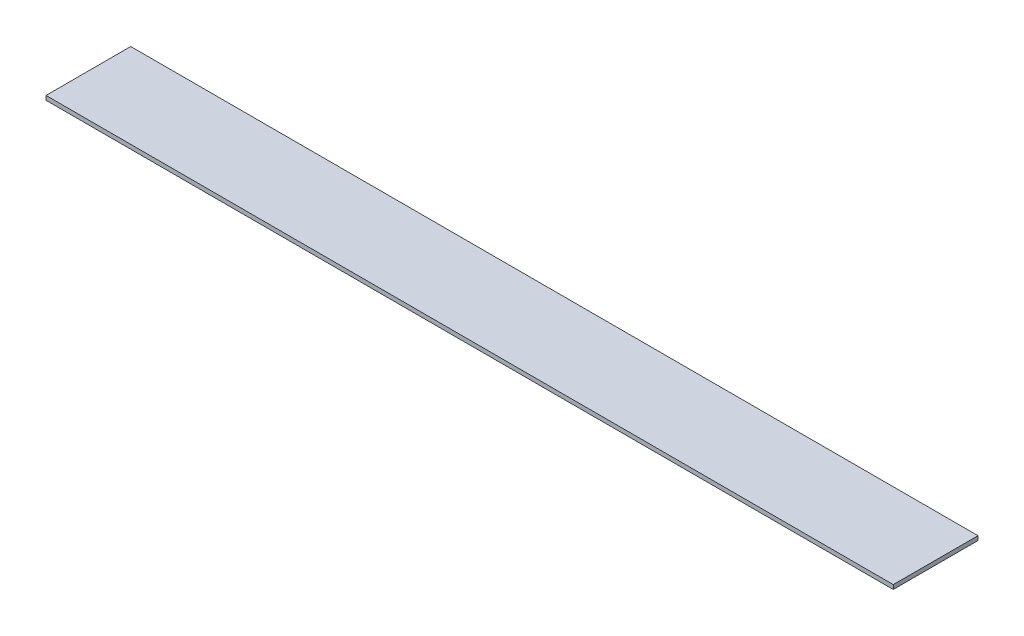
ISO-10303-21;
HEADER;
FILE_DESCRIPTION(('STEP AP214'),'2;1');
FILE_NAME('part.step','',(''),(''),'','','');
FILE_SCHEMA(('AUTOMOTIVE_DESIGN { 1 0 10303 214 1 1 1 1 }'));
ENDSEC;
DATA;
#1=APPLICATION_CONTEXT('core data for automotive mechanical design processes');
#2=APPLICATION_PROTOCOL_DEFINITION('international standard','automotive_design',2000,#1);
#3=PRODUCT_CONTEXT('',#1,'mechanical');
#4=PRODUCT('Part','Part','',(#3));
#5=PRODUCT_RELATED_PRODUCT_CATEGORY('part','',(#4));
#6=PRODUCT_DEFINITION_FORMATION('','',#4);
#7=PRODUCT_DEFINITION_CONTEXT('part definition',#1,'design');
#8=PRODUCT_DEFINITION('design','',#6,#7);
#9=PRODUCT_DEFINITION_SHAPE('','',#8);
#10=(LENGTH_UNIT() NAMED_UNIT(*) SI_UNIT(.MILLI.,.METRE.));
#11=(NAMED_UNIT(*) PLANE_ANGLE_UNIT() SI_UNIT($,.RADIAN.));
#12=(NAMED_UNIT(*) SI_UNIT($,.STERADIAN.) SOLID_ANGLE_UNIT());
#13=UNCERTAINTY_MEASURE_WITH_UNIT(LENGTH_MEASURE(1.E-05),#10,'distance_accuracy_value','');
#14=(GEOMETRIC_REPRESENTATION_CONTEXT(3) GLOBAL_UNCERTAINTY_ASSIGNED_CONTEXT((#13)) GLOBAL_UNIT_ASSIGNED_CONTEXT((#10,
#11,#12)) REPRESENTATION_CONTEXT('',''));
#15=CARTESIAN_POINT('',(0.,0.,0.));
#16=DIRECTION('',(0.,0.,1.));
#17=DIRECTION('',(1.,0.,0.));
#18=AXIS2_PLACEMENT_3D('',#15,#16,#17);
#19=CARTESIAN_POINT('',(300.,1.71683972880179E-13,0.));
#20=DIRECTION('',(-1.,0.,0.));
#21=DIRECTION('',(0.,-1.,0.));
#22=AXIS2_PLACEMENT_3D('',#19,#20,#21);
#23=PLANE('',#22);
#24=DIRECTION('',(0.,-1.,0.));
#25=VECTOR('',#24,1.);
#26=CARTESIAN_POINT('',(300.,3.43367945760358E-13,60.));
#27=LINE('',#26,#25);
#28=CARTESIAN_POINT('',(300.,50.,60.));
#29=VERTEX_POINT('',#28);
#30=CARTESIAN_POINT('',(300.,47.,60.));
#31=VERTEX_POINT('',#30);
#32=EDGE_CURVE('E85',#29,#31,#27,.T.);
#33=ORIENTED_EDGE('',*,*,#32,.T.);
#34=DIRECTION('',(0.,0.,1.));
#35=VECTOR('',#34,1.);
#36=CARTESIAN_POINT('',(300.,47.,3.));
#37=LINE('',#36,#35);
#38=CARTESIAN_POINT('',(300.,47.,0.));
#39=VERTEX_POINT('',#38);
#40=EDGE_CURVE('E41',#39,#31,#37,.T.);
#41=ORIENTED_EDGE('',*,*,#40,.F.);
#42=DIRECTION('',(0.,-1.,0.));
#43=VECTOR('',#42,1.);
#44=CARTESIAN_POINT('',(300.,3.43367945760358E-13,0.));
#45=LINE('',#44,#43);
#46=CARTESIAN_POINT('',(300.,50.,0.));
#47=VERTEX_POINT('',#46);
#48=EDGE_CURVE('E84',#47,#39,#45,.T.);
#49=ORIENTED_EDGE('',*,*,#48,.F.);
#50=DIRECTION('',(0.,0.,-1.));
#51=VECTOR('',#50,1.);
#52=CARTESIAN_POINT('',(300.,50.,60.));
#53=LINE('',#52,#51);
#54=EDGE_CURVE('E56',#29,#47,#53,.T.);
#55=ORIENTED_EDGE('',*,*,#54,.F.);
#56=EDGE_LOOP('',(#33,#41,#49,#55));
#57=FACE_BOUND('',#56,.T.);
#58=ADVANCED_FACE('F32',(#57),#23,.F.);
#59=CARTESIAN_POINT('',(-300.,0.,0.));
#60=DIRECTION('',(-1.,0.,0.));
#61=DIRECTION('',(0.,0.,1.));
#62=AXIS2_PLACEMENT_3D('',#59,#60,#61);
#63=PLANE('',#62);
#64=DIRECTION('',(0.,-1.,0.));
#65=VECTOR('',#64,1.);
#66=CARTESIAN_POINT('',(-300.,0.,60.));
#67=LINE('',#66,#65);
#68=CARTESIAN_POINT('',(-300.,50.,60.));
#69=VERTEX_POINT('',#68);
#70=CARTESIAN_POINT('',(-300.,47.,60.));
#71=VERTEX_POINT('',#70);
#72=EDGE_CURVE('E79',#69,#71,#67,.T.);
#73=ORIENTED_EDGE('',*,*,#72,.F.);
#74=DIRECTION('',(0.,0.,-1.));
#75=VECTOR('',#74,1.);
#76=CARTESIAN_POINT('',(-300.,50.,60.));
#77=LINE('',#76,#75);
#78=CARTESIAN_POINT('',(-300.,50.,0.));
#79=VERTEX_POINT('',#78);
#80=EDGE_CURVE('E91',#69,#79,#77,.T.);
#81=ORIENTED_EDGE('',*,*,#80,.T.);
#82=DIRECTION('',(0.,-1.,0.));
#83=VECTOR('',#82,1.);
#84=CARTESIAN_POINT('',(-300.,0.,0.));
#85=LINE('',#84,#83);
#86=CARTESIAN_POINT('',(-300.,47.,0.));
#87=VERTEX_POINT('',#86);
#88=EDGE_CURVE('E90',#79,#87,#85,.T.);
#89=ORIENTED_EDGE('',*,*,#88,.T.);
#90=DIRECTION('',(0.,0.,1.));
#91=VECTOR('',#90,1.);
#92=CARTESIAN_POINT('',(-300.,47.,3.));
#93=LINE('',#92,#91);
#94=EDGE_CURVE('E36',#87,#71,#93,.T.);
#95=ORIENTED_EDGE('',*,*,#94,.T.);
#96=EDGE_LOOP('',(#73,#81,#89,#95));
#97=FACE_BOUND('',#96,.T.);
#98=ADVANCED_FACE('F88',(#97),#63,.T.);
#99=CARTESIAN_POINT('',(300.,47.,3.));
#100=DIRECTION('',(0.,1.,0.));
#101=DIRECTION('',(0.,0.,1.));
#102=AXIS2_PLACEMENT_3D('',#99,#100,#101);
#103=PLANE('',#102);
#104=DIRECTION('',(-1.,0.,0.));
#105=VECTOR('',#104,1.);
#106=CARTESIAN_POINT('',(300.,47.,60.));
#107=LINE('',#106,#105);
#108=EDGE_CURVE('E11',#31,#71,#107,.T.);
#109=ORIENTED_EDGE('',*,*,#108,.T.);
#110=ORIENTED_EDGE('',*,*,#94,.F.);
#111=DIRECTION('',(1.,0.,0.));
#112=VECTOR('',#111,1.);
#113=CARTESIAN_POINT('',(-300.,47.,0.));
#114=LINE('',#113,#112);
#115=EDGE_CURVE('E95',#87,#39,#114,.T.);
#116=ORIENTED_EDGE('',*,*,#115,.T.);
#117=ORIENTED_EDGE('',*,*,#40,.T.);
#118=EDGE_LOOP('',(#109,#110,#116,#117));
#119=FACE_BOUND('',#118,.T.);
#120=ADVANCED_FACE('F74',(#119),#103,.F.);
#121=CARTESIAN_POINT('',(-300.,50.,60.));
#122=DIRECTION('',(0.,-1.,0.));
#123=DIRECTION('',(0.,0.,-1.));
#124=AXIS2_PLACEMENT_3D('',#121,#122,#123);
#125=PLANE('',#124);
#126=DIRECTION('',(-1.,0.,0.));
#127=VECTOR('',#126,1.);
#128=CARTESIAN_POINT('',(-300.,50.,0.));
#129=LINE('',#128,#127);
#130=EDGE_CURVE('E98',#47,#79,#129,.T.);
#131=ORIENTED_EDGE('',*,*,#130,.T.);
#132=ORIENTED_EDGE('',*,*,#80,.F.);
#133=DIRECTION('',(-1.,0.,0.));
#134=VECTOR('',#133,1.);
#135=CARTESIAN_POINT('',(-300.,50.,60.));
#136=LINE('',#135,#134);
#137=EDGE_CURVE('E80',#29,#69,#136,.T.);
#138=ORIENTED_EDGE('',*,*,#137,.F.);
#139=ORIENTED_EDGE('',*,*,#54,.T.);
#140=EDGE_LOOP('',(#131,#132,#138,#139));
#141=FACE_BOUND('',#140,.T.);
#142=ADVANCED_FACE('F106',(#141),#125,.F.);
#143=CARTESIAN_POINT('',(-300.,0.,0.));
#144=DIRECTION('',(0.,0.,1.));
#145=DIRECTION('',(1.,0.,0.));
#146=AXIS2_PLACEMENT_3D('',#143,#144,#145);
#147=PLANE('',#146);
#148=ORIENTED_EDGE('',*,*,#88,.F.);
#149=ORIENTED_EDGE('',*,*,#130,.F.);
#150=ORIENTED_EDGE('',*,*,#48,.T.);
#151=ORIENTED_EDGE('',*,*,#115,.F.);
#152=EDGE_LOOP('',(#148,#149,#150,#151));
#153=FACE_BOUND('',#152,.T.);
#154=ADVANCED_FACE('F103',(#153),#147,.F.);
#155=CARTESIAN_POINT('',(-300.,0.,60.));
#156=DIRECTION('',(0.,0.,1.));
#157=DIRECTION('',(1.,0.,0.));
#158=AXIS2_PLACEMENT_3D('',#155,#156,#157);
#159=PLANE('',#158);
#160=ORIENTED_EDGE('',*,*,#137,.T.);
#161=ORIENTED_EDGE('',*,*,#72,.T.);
#162=ORIENTED_EDGE('',*,*,#108,.F.);
#163=ORIENTED_EDGE('',*,*,#32,.F.);
#164=EDGE_LOOP('',(#160,#161,#162,#163));
#165=FACE_BOUND('',#164,.T.);
#166=ADVANCED_FACE('F34',(#165),#159,.T.);
#167=CLOSED_SHELL('',(#58,#98,#120,#142,#154,#166));
#168=MANIFOLD_SOLID_BREP('B2',#167);
#169=ADVANCED_BREP_SHAPE_REPRESENTATION('',(#18,#168),#14);
#170=SHAPE_DEFINITION_REPRESENTATION(#9,#169);
ENDSEC;
END-ISO-10303-21;
